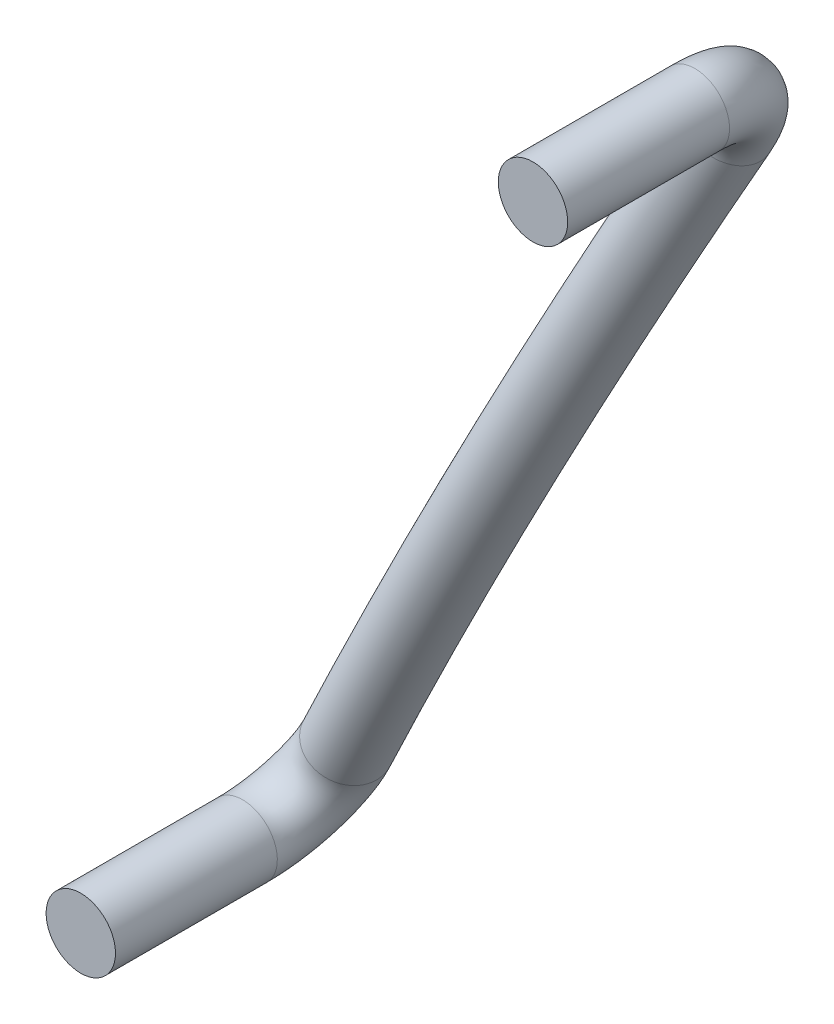
ISO-10303-21;
HEADER;
FILE_DESCRIPTION(('STEP AP214'),'2;1');
FILE_NAME('part.step','',(''),(''),'','','');
FILE_SCHEMA(('AUTOMOTIVE_DESIGN { 1 0 10303 214 1 1 1 1 }'));
ENDSEC;
DATA;
#1=APPLICATION_CONTEXT('core data for automotive mechanical design processes');
#2=APPLICATION_PROTOCOL_DEFINITION('international standard','automotive_design',2000,#1);
#3=PRODUCT_CONTEXT('',#1,'mechanical');
#4=PRODUCT('Part','Part','',(#3));
#5=PRODUCT_RELATED_PRODUCT_CATEGORY('part','',(#4));
#6=PRODUCT_DEFINITION_FORMATION('','',#4);
#7=PRODUCT_DEFINITION_CONTEXT('part definition',#1,'design');
#8=PRODUCT_DEFINITION('design','',#6,#7);
#9=PRODUCT_DEFINITION_SHAPE('','',#8);
#10=(LENGTH_UNIT() NAMED_UNIT(*) SI_UNIT(.MILLI.,.METRE.));
#11=(NAMED_UNIT(*) PLANE_ANGLE_UNIT() SI_UNIT($,.RADIAN.));
#12=(NAMED_UNIT(*) SI_UNIT($,.STERADIAN.) SOLID_ANGLE_UNIT());
#13=UNCERTAINTY_MEASURE_WITH_UNIT(LENGTH_MEASURE(1.E-05),#10,'distance_accuracy_value','');
#14=(GEOMETRIC_REPRESENTATION_CONTEXT(3) GLOBAL_UNCERTAINTY_ASSIGNED_CONTEXT((#13)) GLOBAL_UNIT_ASSIGNED_CONTEXT((#10,
#11,#12)) REPRESENTATION_CONTEXT('',''));
#15=CARTESIAN_POINT('',(0.,0.,0.));
#16=DIRECTION('',(0.,0.,1.));
#17=DIRECTION('',(1.,0.,0.));
#18=AXIS2_PLACEMENT_3D('',#15,#16,#17);
#19=CARTESIAN_POINT('',(174.416251329,-29.672160385,198.148278345));
#20=DIRECTION('',(0.,0.,1.));
#21=DIRECTION('',(1.,0.,0.));
#22=AXIS2_PLACEMENT_3D('',#19,#20,#21);
#23=PLANE('',#22);
#24=CARTESIAN_POINT('',(174.416251329,-29.672160385,198.148278345));
#25=DIRECTION('',(0.,0.,1.));
#26=DIRECTION('',(-0.884972385138754,0.465643509073008,0.));
#27=AXIS2_PLACEMENT_3D('',#24,#25,#26);
#28=CIRCLE('',#27,0.75);
#29=CARTESIAN_POINT('',(173.75252204,-29.322927753,198.148278345));
#30=VERTEX_POINT('',#29);
#31=CARTESIAN_POINT('',(174.76548396,-29.008431096,198.148278345));
#32=VERTEX_POINT('',#31);
#33=EDGE_CURVE('E20',#30,#32,#28,.T.);
#34=ORIENTED_EDGE('',*,*,#33,.T.);
#35=CARTESIAN_POINT('',(174.416251329,-29.672160385,198.148278345));
#36=DIRECTION('',(0.,0.,1.));
#37=DIRECTION('',(-0.884972385138754,0.465643509073008,0.));
#38=AXIS2_PLACEMENT_3D('',#35,#36,#37);
#39=CIRCLE('',#38,0.75);
#40=EDGE_CURVE('E11',#32,#30,#39,.T.);
#41=ORIENTED_EDGE('',*,*,#40,.T.);
#42=EDGE_LOOP('',(#34,#41));
#43=FACE_BOUND('',#42,.T.);
#44=ADVANCED_FACE('F16',(#43),#23,.T.);
#45=CARTESIAN_POINT('',(164.637737646,-48.256580477,198.148278346));
#46=DIRECTION('',(0.,0.,-1.));
#47=DIRECTION('',(0.,-1.,0.));
#48=AXIS2_PLACEMENT_3D('',#45,#46,#47);
#49=PLANE('',#48);
#50=CARTESIAN_POINT('',(164.637737646,-48.256580477,198.148278346));
#51=DIRECTION('',(0.,0.,-1.));
#52=DIRECTION('',(0.465643509073008,0.884972385138754,0.));
#53=AXIS2_PLACEMENT_3D('',#50,#51,#52);
#54=CIRCLE('',#53,0.75);
#55=CARTESIAN_POINT('',(164.288505014,-48.920309766,198.148278346));
#56=VERTEX_POINT('',#55);
#57=CARTESIAN_POINT('',(164.986970277,-47.592851188,198.148278346));
#58=VERTEX_POINT('',#57);
#59=EDGE_CURVE('E128',#56,#58,#54,.T.);
#60=ORIENTED_EDGE('',*,*,#59,.F.);
#61=CARTESIAN_POINT('',(164.637737646,-48.256580477,198.148278346));
#62=DIRECTION('',(0.,0.,-1.));
#63=DIRECTION('',(0.465643509073008,0.884972385138754,0.));
#64=AXIS2_PLACEMENT_3D('',#61,#62,#63);
#65=CIRCLE('',#64,0.75);
#66=EDGE_CURVE('E67',#58,#56,#65,.T.);
#67=ORIENTED_EDGE('',*,*,#66,.F.);
#68=EDGE_LOOP('',(#60,#67));
#69=FACE_BOUND('',#68,.T.);
#70=ADVANCED_FACE('F142',(#69),#49,.F.);
#71=CARTESIAN_POINT('',(174.416251329,-29.672160385,198.148278345));
#72=DIRECTION('',(0.,0.,-1.));
#73=DIRECTION('',(0.465643509073008,0.884972385138754,0.));
#74=AXIS2_PLACEMENT_3D('',#71,#72,#73);
#75=CYLINDRICAL_SURFACE('',#74,0.75);
#76=DIRECTION('',(0.,0.,1.));
#77=VECTOR('',#76,1.);
#78=CARTESIAN_POINT('',(174.76548396,-29.008431096,194.648278345));
#79=LINE('',#78,#77);
#80=CARTESIAN_POINT('',(174.76548396,-29.008431096,194.648278345));
#81=VERTEX_POINT('',#80);
#82=EDGE_CURVE('E84',#81,#32,#79,.T.);
#83=ORIENTED_EDGE('',*,*,#82,.T.);
#84=ORIENTED_EDGE('',*,*,#33,.F.);
#85=ORIENTED_EDGE('',*,*,#40,.F.);
#86=ORIENTED_EDGE('',*,*,#82,.F.);
#87=CARTESIAN_POINT('',(174.416251329,-29.672160385,194.648278345));
#88=DIRECTION('',(0.,0.,1.));
#89=DIRECTION('',(-0.884972385138754,0.465643509073008,0.));
#90=AXIS2_PLACEMENT_3D('',#87,#88,#89);
#91=CIRCLE('',#90,0.75);
#92=CARTESIAN_POINT('',(173.75252204,-29.322927753,194.648278345));
#93=VERTEX_POINT('',#92);
#94=EDGE_CURVE('E88',#81,#93,#91,.T.);
#95=ORIENTED_EDGE('',*,*,#94,.T.);
#96=CARTESIAN_POINT('',(174.416251329,-29.672160385,194.648278345));
#97=DIRECTION('',(0.,0.,1.));
#98=DIRECTION('',(-0.884972385138754,0.465643509073008,0.));
#99=AXIS2_PLACEMENT_3D('',#96,#97,#98);
#100=CIRCLE('',#99,0.75);
#101=EDGE_CURVE('E98',#93,#81,#100,.T.);
#102=ORIENTED_EDGE('',*,*,#101,.T.);
#103=EDGE_LOOP('',(#83,#84,#85,#86,#95,#102));
#104=FACE_BOUND('',#103,.T.);
#105=ADVANCED_FACE('F86',(#104),#75,.T.);
#106=CARTESIAN_POINT('',(173.717786065,-30.999618963,194.648278345));
#107=DIRECTION('',(-0.884972385138754,0.465643509073008,0.));
#108=DIRECTION('',(0.465643509073008,0.884972385138754,0.));
#109=AXIS2_PLACEMENT_3D('',#106,#107,#108);
#110=TOROIDAL_SURFACE('',#109,1.5,0.75);
#111=CARTESIAN_POINT('',(173.717786065,-30.999618963,194.648278345));
#112=DIRECTION('',(0.884972385138754,-0.465643509073008,0.));
#113=DIRECTION('',(0.465643509073008,0.884972385138754,0.));
#114=AXIS2_PLACEMENT_3D('',#111,#112,#113);
#115=CIRCLE('',#114,2.25);
#116=CARTESIAN_POINT('',(173.624886745,-31.176177493,192.407140955));
#117=VERTEX_POINT('',#116);
#118=EDGE_CURVE('E96',#117,#81,#115,.T.);
#119=ORIENTED_EDGE('',*,*,#118,.T.);
#120=ORIENTED_EDGE('',*,*,#101,.F.);
#121=ORIENTED_EDGE('',*,*,#94,.F.);
#122=ORIENTED_EDGE('',*,*,#118,.F.);
#123=CARTESIAN_POINT('',(173.655853185,-31.117324649,193.154186752));
#124=DIRECTION('',(0.463809368077701,0.881486534147674,-0.0886699509399071));
#125=DIRECTION('',(-0.0412885870118136,-0.0784704580224522,-0.996061062284996));
#126=AXIS2_PLACEMENT_3D('',#123,#124,#125);
#127=CIRCLE('',#126,0.75);
#128=CARTESIAN_POINT('',(173.686819625,-31.058471806,193.901232549));
#129=VERTEX_POINT('',#128);
#130=EDGE_CURVE('E111',#117,#129,#127,.T.);
#131=ORIENTED_EDGE('',*,*,#130,.T.);
#132=CARTESIAN_POINT('',(173.655853185,-31.117324649,193.154186752));
#133=DIRECTION('',(0.463809368077701,0.881486534147674,-0.0886699509399071));
#134=DIRECTION('',(-0.0412885870118136,-0.0784704580224522,-0.996061062284996));
#135=AXIS2_PLACEMENT_3D('',#132,#133,#134);
#136=CIRCLE('',#135,0.75);
#137=EDGE_CURVE('E104',#129,#117,#136,.T.);
#138=ORIENTED_EDGE('',*,*,#137,.T.);
#139=EDGE_LOOP('',(#119,#120,#121,#122,#131,#138));
#140=FACE_BOUND('',#139,.T.);
#141=ADVANCED_FACE('F94',(#140),#110,.T.);
#142=CARTESIAN_POINT('',(169.526994485,-38.964370431,93.548080522));
#143=DIRECTION('',(0.884972385138754,-0.465643509073008,0.));
#144=DIRECTION('',(-0.465643509073008,-0.884972385138754,0.));
#145=AXIS2_PLACEMENT_3D('',#142,#143,#144);
#146=TOROIDAL_SURFACE('',#145,100.,0.75);
#147=CARTESIAN_POINT('',(169.526994485,-38.964370431,93.548080522));
#148=DIRECTION('',(-0.884972385138754,0.465643509073008,0.));
#149=DIRECTION('',(-0.465643509073008,-0.884972385138754,0.));
#150=AXIS2_PLACEMENT_3D('',#147,#148,#149);
#151=CIRCLE('',#150,100.75);
#152=CARTESIAN_POINT('',(165.367169349,-46.870269055,193.901232549));
#153=VERTEX_POINT('',#152);
#154=EDGE_CURVE('E117',#153,#129,#151,.T.);
#155=ORIENTED_EDGE('',*,*,#154,.T.);
#156=ORIENTED_EDGE('',*,*,#130,.F.);
#157=ORIENTED_EDGE('',*,*,#137,.F.);
#158=ORIENTED_EDGE('',*,*,#154,.F.);
#159=CARTESIAN_POINT('',(165.398135789,-46.811416212,193.154186752));
#160=DIRECTION('',(0.463809368077701,0.881486534147674,0.0886699509399071));
#161=DIRECTION('',(0.0412885870118136,0.0784704580224522,-0.996061062284996));
#162=AXIS2_PLACEMENT_3D('',#159,#160,#161);
#163=CIRCLE('',#162,0.75);
#164=CARTESIAN_POINT('',(165.429102229,-46.752563368,192.407140955));
#165=VERTEX_POINT('',#164);
#166=EDGE_CURVE('E122',#153,#165,#163,.T.);
#167=ORIENTED_EDGE('',*,*,#166,.T.);
#168=CARTESIAN_POINT('',(165.398135789,-46.811416212,193.154186752));
#169=DIRECTION('',(0.463809368077701,0.881486534147674,0.0886699509399071));
#170=DIRECTION('',(0.0412885870118136,0.0784704580224522,-0.996061062284996));
#171=AXIS2_PLACEMENT_3D('',#168,#169,#170);
#172=CIRCLE('',#171,0.75);
#173=EDGE_CURVE('E121',#165,#153,#172,.T.);
#174=ORIENTED_EDGE('',*,*,#173,.T.);
#175=EDGE_LOOP('',(#155,#156,#157,#158,#167,#174));
#176=FACE_BOUND('',#175,.T.);
#177=ADVANCED_FACE('F18',(#176),#146,.T.);
#178=CARTESIAN_POINT('',(165.336202909,-46.929121899,194.648278346));
#179=DIRECTION('',(-0.884972385138754,0.465643509073008,0.));
#180=DIRECTION('',(0.465643509073008,0.884972385138754,0.));
#181=AXIS2_PLACEMENT_3D('',#178,#179,#180);
#182=TOROIDAL_SURFACE('',#181,1.5,0.75);
#183=CARTESIAN_POINT('',(165.336202909,-46.929121899,194.648278346));
#184=DIRECTION('',(0.884972385138754,-0.465643509073008,0.));
#185=DIRECTION('',(0.465643509073008,0.884972385138754,0.));
#186=AXIS2_PLACEMENT_3D('',#183,#184,#185);
#187=CIRCLE('',#186,2.25);
#188=CARTESIAN_POINT('',(164.288505014,-48.920309766,194.648278346));
#189=VERTEX_POINT('',#188);
#190=EDGE_CURVE('E55',#189,#165,#187,.T.);
#191=ORIENTED_EDGE('',*,*,#190,.T.);
#192=ORIENTED_EDGE('',*,*,#166,.F.);
#193=ORIENTED_EDGE('',*,*,#173,.F.);
#194=ORIENTED_EDGE('',*,*,#190,.F.);
#195=CARTESIAN_POINT('',(164.637737646,-48.256580477,194.648278346));
#196=DIRECTION('',(0.,0.,-1.));
#197=DIRECTION('',(-0.465643509073008,-0.884972385138754,0.));
#198=AXIS2_PLACEMENT_3D('',#195,#196,#197);
#199=CIRCLE('',#198,0.75);
#200=EDGE_CURVE('E115',#189,#189,#199,.T.);
#201=ORIENTED_EDGE('',*,*,#200,.T.);
#202=EDGE_LOOP('',(#191,#192,#193,#194,#201));
#203=FACE_BOUND('',#202,.T.);
#204=ADVANCED_FACE('F155',(#203),#182,.T.);
#205=CARTESIAN_POINT('',(164.637737646,-48.256580477,194.648278346));
#206=DIRECTION('',(0.,0.,1.));
#207=DIRECTION('',(-0.465643509073008,-0.884972385138754,0.));
#208=AXIS2_PLACEMENT_3D('',#205,#206,#207);
#209=CYLINDRICAL_SURFACE('',#208,0.75);
#210=DIRECTION('',(0.,0.,-1.));
#211=VECTOR('',#210,1.);
#212=CARTESIAN_POINT('',(164.288505014,-48.920309766,198.148278346));
#213=LINE('',#212,#211);
#214=EDGE_CURVE('E114',#56,#189,#213,.T.);
#215=ORIENTED_EDGE('',*,*,#214,.T.);
#216=ORIENTED_EDGE('',*,*,#200,.F.);
#217=ORIENTED_EDGE('',*,*,#214,.F.);
#218=ORIENTED_EDGE('',*,*,#59,.T.);
#219=ORIENTED_EDGE('',*,*,#66,.T.);
#220=EDGE_LOOP('',(#215,#216,#217,#218,#219));
#221=FACE_BOUND('',#220,.T.);
#222=ADVANCED_FACE('F139',(#221),#209,.T.);
#223=CLOSED_SHELL('',(#44,#70,#105,#141,#177,#204,#222));
#224=MANIFOLD_SOLID_BREP('B1',#223);
#225=ADVANCED_BREP_SHAPE_REPRESENTATION('',(#18,#224),#14);
#226=SHAPE_DEFINITION_REPRESENTATION(#9,#225);
ENDSEC;
END-ISO-10303-21;
